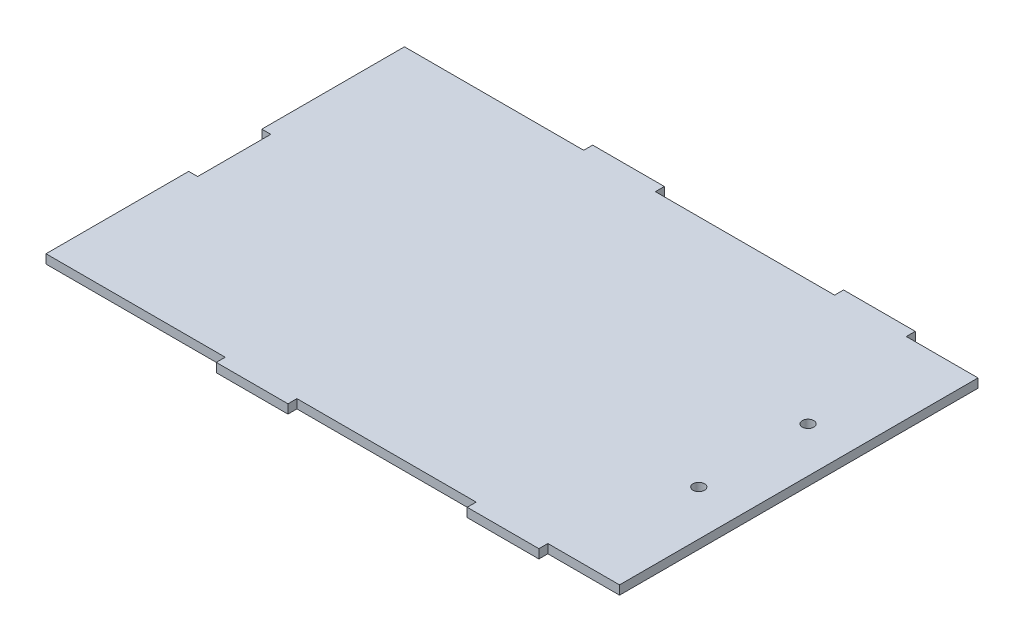
ISO-10303-21;
HEADER;
FILE_DESCRIPTION(('STEP AP214'),'2;1');
FILE_NAME('part.step','',(''),(''),'','','');
FILE_SCHEMA(('AUTOMOTIVE_DESIGN { 1 0 10303 214 1 1 1 1 }'));
ENDSEC;
DATA;
#1=APPLICATION_CONTEXT('core data for automotive mechanical design processes');
#2=APPLICATION_PROTOCOL_DEFINITION('international standard','automotive_design',2000,#1);
#3=PRODUCT_CONTEXT('',#1,'mechanical');
#4=PRODUCT('Part','Part','',(#3));
#5=PRODUCT_RELATED_PRODUCT_CATEGORY('part','',(#4));
#6=PRODUCT_DEFINITION_FORMATION('','',#4);
#7=PRODUCT_DEFINITION_CONTEXT('part definition',#1,'design');
#8=PRODUCT_DEFINITION('design','',#6,#7);
#9=PRODUCT_DEFINITION_SHAPE('','',#8);
#10=(LENGTH_UNIT() NAMED_UNIT(*) SI_UNIT(.MILLI.,.METRE.));
#11=(NAMED_UNIT(*) PLANE_ANGLE_UNIT() SI_UNIT($,.RADIAN.));
#12=(NAMED_UNIT(*) SI_UNIT($,.STERADIAN.) SOLID_ANGLE_UNIT());
#13=UNCERTAINTY_MEASURE_WITH_UNIT(LENGTH_MEASURE(1.E-05),#10,'distance_accuracy_value','');
#14=(GEOMETRIC_REPRESENTATION_CONTEXT(3) GLOBAL_UNCERTAINTY_ASSIGNED_CONTEXT((#13)) GLOBAL_UNIT_ASSIGNED_CONTEXT((#10,
#11,#12)) REPRESENTATION_CONTEXT('',''));
#15=CARTESIAN_POINT('',(0.,0.,0.));
#16=DIRECTION('',(0.,0.,1.));
#17=DIRECTION('',(1.,0.,0.));
#18=AXIS2_PLACEMENT_3D('',#15,#16,#17);
#19=CARTESIAN_POINT('',(-59.2381545070437,3.175,-74.9935826896622));
#20=DIRECTION('',(1.,0.,0.));
#21=DIRECTION('',(0.,0.,-1.));
#22=AXIS2_PLACEMENT_3D('',#19,#20,#21);
#23=PLANE('',#22);
#24=DIRECTION('',(0.,0.,1.));
#25=VECTOR('',#24,1.);
#26=CARTESIAN_POINT('',(-59.2381545070437,3.175,-74.9935826896622));
#27=LINE('',#26,#25);
#28=CARTESIAN_POINT('',(-59.2381545070437,3.175,1.46041731033783));
#29=VERTEX_POINT('',#28);
#30=CARTESIAN_POINT('',(-59.2381545070437,3.175,52.0064173103378));
#31=VERTEX_POINT('',#30);
#32=EDGE_CURVE('E354',#29,#31,#27,.T.);
#33=ORIENTED_EDGE('',*,*,#32,.F.);
#34=DIRECTION('',(0.,1.,0.));
#35=VECTOR('',#34,1.);
#36=CARTESIAN_POINT('',(-59.2381545070437,3.175,1.46041731033783));
#37=LINE('',#36,#35);
#38=CARTESIAN_POINT('',(-59.2381545070437,0.,1.46041731033784));
#39=VERTEX_POINT('',#38);
#40=EDGE_CURVE('E200',#39,#29,#37,.T.);
#41=ORIENTED_EDGE('',*,*,#40,.F.);
#42=DIRECTION('',(0.,0.,1.));
#43=VECTOR('',#42,1.);
#44=CARTESIAN_POINT('',(-59.2381545070437,0.,-74.9935826896622));
#45=LINE('',#44,#43);
#46=CARTESIAN_POINT('',(-59.2381545070437,0.,52.0064173103378));
#47=VERTEX_POINT('',#46);
#48=EDGE_CURVE('E348',#39,#47,#45,.T.);
#49=ORIENTED_EDGE('',*,*,#48,.T.);
#50=DIRECTION('',(0.,-1.,0.));
#51=VECTOR('',#50,1.);
#52=CARTESIAN_POINT('',(-59.2381545070437,3.175,52.0064173103378));
#53=LINE('',#52,#51);
#54=EDGE_CURVE('E11',#31,#47,#53,.T.);
#55=ORIENTED_EDGE('',*,*,#54,.F.);
#56=EDGE_LOOP('',(#33,#41,#49,#55));
#57=FACE_BOUND('',#56,.T.);
#58=ADVANCED_FACE('F33',(#57),#23,.F.);
#59=CARTESIAN_POINT('',(-59.2381545070437,3.175,-74.9935826896622));
#60=DIRECTION('',(0.,0.,1.));
#61=DIRECTION('',(1.,0.,0.));
#62=AXIS2_PLACEMENT_3D('',#59,#60,#61);
#63=PLANE('',#62);
#64=DIRECTION('',(0.,-1.,0.));
#65=VECTOR('',#64,1.);
#66=CARTESIAN_POINT('',(29.6618454929563,3.175,-74.9935826896622));
#67=LINE('',#66,#65);
#68=CARTESIAN_POINT('',(29.6618454929563,3.175,-74.9935826896622));
#69=VERTEX_POINT('',#68);
#70=CARTESIAN_POINT('',(29.6618454929563,0.,-74.9935826896622));
#71=VERTEX_POINT('',#70);
#72=EDGE_CURVE('E227',#69,#71,#67,.T.);
#73=ORIENTED_EDGE('',*,*,#72,.F.);
#74=DIRECTION('',(-1.,0.,0.));
#75=VECTOR('',#74,1.);
#76=CARTESIAN_POINT('',(-59.2381545070437,3.175,-74.9935826896622));
#77=LINE('',#76,#75);
#78=CARTESIAN_POINT('',(93.1618454929563,3.175,-74.9935826896622));
#79=VERTEX_POINT('',#78);
#80=EDGE_CURVE('E365',#79,#69,#77,.T.);
#81=ORIENTED_EDGE('',*,*,#80,.F.);
#82=DIRECTION('',(0.,1.,0.));
#83=VECTOR('',#82,1.);
#84=CARTESIAN_POINT('',(93.1618454929563,3.175,-74.9935826896622));
#85=LINE('',#84,#83);
#86=CARTESIAN_POINT('',(93.1618454929563,0.,-74.9935826896622));
#87=VERTEX_POINT('',#86);
#88=EDGE_CURVE('E262',#87,#79,#85,.T.);
#89=ORIENTED_EDGE('',*,*,#88,.F.);
#90=DIRECTION('',(-1.,0.,0.));
#91=VECTOR('',#90,1.);
#92=CARTESIAN_POINT('',(-59.2381545070437,0.,-74.9935826896622));
#93=LINE('',#92,#91);
#94=EDGE_CURVE('E378',#87,#71,#93,.T.);
#95=ORIENTED_EDGE('',*,*,#94,.T.);
#96=EDGE_LOOP('',(#73,#81,#89,#95));
#97=FACE_BOUND('',#96,.T.);
#98=ADVANCED_FACE('F418',(#97),#63,.F.);
#99=DIRECTION('',(0.,1.,0.));
#100=VECTOR('',#99,1.);
#101=CARTESIAN_POINT('',(4.26184549295627,3.17500000000003,-74.9935826896622));
#102=LINE('',#101,#100);
#103=CARTESIAN_POINT('',(4.26184549295627,0.,-74.9935826896622));
#104=VERTEX_POINT('',#103);
#105=CARTESIAN_POINT('',(4.26184549295627,3.175,-74.9935826896622));
#106=VERTEX_POINT('',#105);
#107=EDGE_CURVE('E236',#104,#106,#102,.T.);
#108=ORIENTED_EDGE('',*,*,#107,.F.);
#109=CARTESIAN_POINT('',(-59.2381545070437,0.,-74.9935826896622));
#110=VERTEX_POINT('',#109);
#111=EDGE_CURVE('E375',#104,#110,#93,.T.);
#112=ORIENTED_EDGE('',*,*,#111,.T.);
#113=DIRECTION('',(0.,-1.,0.));
#114=VECTOR('',#113,1.);
#115=CARTESIAN_POINT('',(-59.2381545070437,3.175,-74.9935826896622));
#116=LINE('',#115,#114);
#117=CARTESIAN_POINT('',(-59.2381545070437,3.175,-74.9935826896622));
#118=VERTEX_POINT('',#117);
#119=EDGE_CURVE('E364',#118,#110,#116,.T.);
#120=ORIENTED_EDGE('',*,*,#119,.F.);
#121=EDGE_CURVE('E56',#106,#118,#77,.T.);
#122=ORIENTED_EDGE('',*,*,#121,.F.);
#123=EDGE_LOOP('',(#108,#112,#120,#122));
#124=FACE_BOUND('',#123,.T.);
#125=ADVANCED_FACE('F420',(#124),#63,.F.);
#126=DIRECTION('',(0.,-1.,0.));
#127=VECTOR('',#126,1.);
#128=CARTESIAN_POINT('',(118.561845492956,3.175,-74.9935826896622));
#129=LINE('',#128,#127);
#130=CARTESIAN_POINT('',(118.561845492956,3.175,-74.9935826896622));
#131=VERTEX_POINT('',#130);
#132=CARTESIAN_POINT('',(118.561845492956,0.,-74.9935826896622));
#133=VERTEX_POINT('',#132);
#134=EDGE_CURVE('E257',#131,#133,#129,.T.);
#135=ORIENTED_EDGE('',*,*,#134,.F.);
#136=CARTESIAN_POINT('',(143.961845492956,3.175,-74.9935826896622));
#137=VERTEX_POINT('',#136);
#138=EDGE_CURVE('E361',#137,#131,#77,.T.);
#139=ORIENTED_EDGE('',*,*,#138,.F.);
#140=DIRECTION('',(0.,-1.,0.));
#141=VECTOR('',#140,1.);
#142=CARTESIAN_POINT('',(143.961845492956,3.175,-74.9935826896622));
#143=LINE('',#142,#141);
#144=CARTESIAN_POINT('',(143.961845492956,0.,-74.9935826896622));
#145=VERTEX_POINT('',#144);
#146=EDGE_CURVE('E381',#137,#145,#143,.T.);
#147=ORIENTED_EDGE('',*,*,#146,.T.);
#148=EDGE_CURVE('E376',#145,#133,#93,.T.);
#149=ORIENTED_EDGE('',*,*,#148,.T.);
#150=EDGE_LOOP('',(#135,#139,#147,#149));
#151=FACE_BOUND('',#150,.T.);
#152=ADVANCED_FACE('F400',(#151),#63,.F.);
#153=CARTESIAN_POINT('',(-59.2381545070437,3.175,52.0064173103378));
#154=DIRECTION('',(0.,0.,-1.));
#155=DIRECTION('',(-1.,0.,0.));
#156=AXIS2_PLACEMENT_3D('',#153,#154,#155);
#157=PLANE('',#156);
#158=DIRECTION('',(0.,-1.,0.));
#159=VECTOR('',#158,1.);
#160=CARTESIAN_POINT('',(93.1618454929563,3.175,52.0064173103378));
#161=LINE('',#160,#159);
#162=CARTESIAN_POINT('',(93.1618454929563,3.175,52.0064173103378));
#163=VERTEX_POINT('',#162);
#164=CARTESIAN_POINT('',(93.1618454929563,0.,52.0064173103378));
#165=VERTEX_POINT('',#164);
#166=EDGE_CURVE('E284',#163,#165,#161,.T.);
#167=ORIENTED_EDGE('',*,*,#166,.F.);
#168=DIRECTION('',(1.,0.,0.));
#169=VECTOR('',#168,1.);
#170=CARTESIAN_POINT('',(-59.2381545070437,3.175,52.0064173103378));
#171=LINE('',#170,#169);
#172=CARTESIAN_POINT('',(29.6618454929563,3.175,52.0064173103378));
#173=VERTEX_POINT('',#172);
#174=EDGE_CURVE('E359',#173,#163,#171,.T.);
#175=ORIENTED_EDGE('',*,*,#174,.F.);
#176=DIRECTION('',(0.,1.,0.));
#177=VECTOR('',#176,1.);
#178=CARTESIAN_POINT('',(29.6618454929563,3.175,52.0064173103378));
#179=LINE('',#178,#177);
#180=CARTESIAN_POINT('',(29.6618454929563,0.,52.0064173103378));
#181=VERTEX_POINT('',#180);
#182=EDGE_CURVE('E311',#181,#173,#179,.T.);
#183=ORIENTED_EDGE('',*,*,#182,.F.);
#184=DIRECTION('',(1.,0.,0.));
#185=VECTOR('',#184,1.);
#186=CARTESIAN_POINT('',(-59.2381545070437,0.,52.0064173103378));
#187=LINE('',#186,#185);
#188=EDGE_CURVE('E373',#181,#165,#187,.T.);
#189=ORIENTED_EDGE('',*,*,#188,.T.);
#190=EDGE_LOOP('',(#167,#175,#183,#189));
#191=FACE_BOUND('',#190,.T.);
#192=ADVANCED_FACE('F465',(#191),#157,.F.);
#193=DIRECTION('',(0.,1.,0.));
#194=VECTOR('',#193,1.);
#195=CARTESIAN_POINT('',(118.561845492956,3.175,52.0064173103378));
#196=LINE('',#195,#194);
#197=CARTESIAN_POINT('',(118.561845492956,0.,52.0064173103378));
#198=VERTEX_POINT('',#197);
#199=CARTESIAN_POINT('',(118.561845492956,3.175,52.0064173103378));
#200=VERTEX_POINT('',#199);
#201=EDGE_CURVE('E289',#198,#200,#196,.T.);
#202=ORIENTED_EDGE('',*,*,#201,.F.);
#203=CARTESIAN_POINT('',(143.961845492956,0.,52.0064173103378));
#204=VERTEX_POINT('',#203);
#205=EDGE_CURVE('E369',#198,#204,#187,.T.);
#206=ORIENTED_EDGE('',*,*,#205,.T.);
#207=DIRECTION('',(0.,-1.,0.));
#208=VECTOR('',#207,1.);
#209=CARTESIAN_POINT('',(143.961845492956,3.175,52.0064173103378));
#210=LINE('',#209,#208);
#211=CARTESIAN_POINT('',(143.961845492956,3.175,52.0064173103378));
#212=VERTEX_POINT('',#211);
#213=EDGE_CURVE('E41',#212,#204,#210,.T.);
#214=ORIENTED_EDGE('',*,*,#213,.F.);
#215=EDGE_CURVE('E353',#200,#212,#171,.T.);
#216=ORIENTED_EDGE('',*,*,#215,.F.);
#217=EDGE_LOOP('',(#202,#206,#214,#216));
#218=FACE_BOUND('',#217,.T.);
#219=ADVANCED_FACE('F467',(#218),#157,.F.);
#220=DIRECTION('',(0.,-1.,0.));
#221=VECTOR('',#220,1.);
#222=CARTESIAN_POINT('',(4.26184549295627,3.175,52.0064173103378));
#223=LINE('',#222,#221);
#224=CARTESIAN_POINT('',(4.26184549295627,3.175,52.0064173103378));
#225=VERTEX_POINT('',#224);
#226=CARTESIAN_POINT('',(4.26184549295627,0.,52.0064173103378));
#227=VERTEX_POINT('',#226);
#228=EDGE_CURVE('E316',#225,#227,#223,.T.);
#229=ORIENTED_EDGE('',*,*,#228,.F.);
#230=EDGE_CURVE('E355',#31,#225,#171,.T.);
#231=ORIENTED_EDGE('',*,*,#230,.F.);
#232=ORIENTED_EDGE('',*,*,#54,.T.);
#233=EDGE_CURVE('E370',#47,#227,#187,.T.);
#234=ORIENTED_EDGE('',*,*,#233,.T.);
#235=EDGE_LOOP('',(#229,#231,#232,#234));
#236=FACE_BOUND('',#235,.T.);
#237=ADVANCED_FACE('F461',(#236),#157,.F.);
#238=CARTESIAN_POINT('',(0.,3.175,0.));
#239=DIRECTION('',(0.,1.,0.));
#240=DIRECTION('',(0.,0.,1.));
#241=AXIS2_PLACEMENT_3D('',#238,#239,#240);
#242=PLANE('',#241);
#243=DIRECTION('',(-1.,0.,0.));
#244=VECTOR('',#243,1.);
#245=CARTESIAN_POINT('',(-56.0631545070437,3.175,1.46041731033783));
#246=LINE('',#245,#244);
#247=CARTESIAN_POINT('',(-56.0631545070437,3.175,1.46041731033783));
#248=VERTEX_POINT('',#247);
#249=EDGE_CURVE('E194',#248,#29,#246,.T.);
#250=ORIENTED_EDGE('',*,*,#249,.T.);
#251=ORIENTED_EDGE('',*,*,#32,.T.);
#252=ORIENTED_EDGE('',*,*,#230,.T.);
#253=DIRECTION('',(0.,0.,-1.));
#254=VECTOR('',#253,1.);
#255=CARTESIAN_POINT('',(4.26184549295627,3.175,55.1814173103378));
#256=LINE('',#255,#254);
#257=CARTESIAN_POINT('',(4.26184549295627,3.175,55.1814173103378));
#258=VERTEX_POINT('',#257);
#259=EDGE_CURVE('E332',#258,#225,#256,.T.);
#260=ORIENTED_EDGE('',*,*,#259,.F.);
#261=DIRECTION('',(-1.,0.,0.));
#262=VECTOR('',#261,1.);
#263=CARTESIAN_POINT('',(29.6618454929563,3.175,55.1814173103378));
#264=LINE('',#263,#262);
#265=CARTESIAN_POINT('',(29.6618454929563,3.175,55.1814173103378));
#266=VERTEX_POINT('',#265);
#267=EDGE_CURVE('E315',#266,#258,#264,.T.);
#268=ORIENTED_EDGE('',*,*,#267,.F.);
#269=DIRECTION('',(0.,0.,-1.));
#270=VECTOR('',#269,1.);
#271=CARTESIAN_POINT('',(29.6618454929563,3.175,55.1814173103378));
#272=LINE('',#271,#270);
#273=EDGE_CURVE('E335',#266,#173,#272,.T.);
#274=ORIENTED_EDGE('',*,*,#273,.T.);
#275=ORIENTED_EDGE('',*,*,#174,.T.);
#276=DIRECTION('',(0.,0.,-1.));
#277=VECTOR('',#276,1.);
#278=CARTESIAN_POINT('',(93.1618454929563,3.175,55.1814173103378));
#279=LINE('',#278,#277);
#280=CARTESIAN_POINT('',(93.1618454929563,3.175,55.1814173103378));
#281=VERTEX_POINT('',#280);
#282=EDGE_CURVE('E295',#281,#163,#279,.T.);
#283=ORIENTED_EDGE('',*,*,#282,.F.);
#284=DIRECTION('',(-1.,0.,0.));
#285=VECTOR('',#284,1.);
#286=CARTESIAN_POINT('',(93.1618454929563,3.175,55.1814173103378));
#287=LINE('',#286,#285);
#288=CARTESIAN_POINT('',(118.561845492956,3.175,55.1814173103378));
#289=VERTEX_POINT('',#288);
#290=EDGE_CURVE('E293',#289,#281,#287,.T.);
#291=ORIENTED_EDGE('',*,*,#290,.F.);
#292=DIRECTION('',(0.,0.,-1.));
#293=VECTOR('',#292,1.);
#294=CARTESIAN_POINT('',(118.561845492956,3.175,55.1814173103378));
#295=LINE('',#294,#293);
#296=EDGE_CURVE('E302',#289,#200,#295,.T.);
#297=ORIENTED_EDGE('',*,*,#296,.T.);
#298=ORIENTED_EDGE('',*,*,#215,.T.);
#299=DIRECTION('',(0.,0.,-1.));
#300=VECTOR('',#299,1.);
#301=CARTESIAN_POINT('',(143.961845492956,3.175,-74.9935826896622));
#302=LINE('',#301,#300);
#303=EDGE_CURVE('E358',#212,#137,#302,.T.);
#304=ORIENTED_EDGE('',*,*,#303,.T.);
#305=ORIENTED_EDGE('',*,*,#138,.T.);
#306=DIRECTION('',(0.,0.,1.));
#307=VECTOR('',#306,1.);
#308=CARTESIAN_POINT('',(118.561845492956,3.175,-78.1685826896622));
#309=LINE('',#308,#307);
#310=CARTESIAN_POINT('',(118.561845492956,3.175,-78.1685826896622));
#311=VERTEX_POINT('',#310);
#312=EDGE_CURVE('E268',#311,#131,#309,.T.);
#313=ORIENTED_EDGE('',*,*,#312,.F.);
#314=DIRECTION('',(1.,0.,0.));
#315=VECTOR('',#314,1.);
#316=CARTESIAN_POINT('',(118.561845492956,3.175,-78.1685826896622));
#317=LINE('',#316,#315);
#318=CARTESIAN_POINT('',(93.1618454929563,3.175,-78.1685826896622));
#319=VERTEX_POINT('',#318);
#320=EDGE_CURVE('E266',#319,#311,#317,.T.);
#321=ORIENTED_EDGE('',*,*,#320,.F.);
#322=DIRECTION('',(0.,0.,1.));
#323=VECTOR('',#322,1.);
#324=CARTESIAN_POINT('',(93.1618454929563,3.175,-78.1685826896622));
#325=LINE('',#324,#323);
#326=EDGE_CURVE('E275',#319,#79,#325,.T.);
#327=ORIENTED_EDGE('',*,*,#326,.T.);
#328=ORIENTED_EDGE('',*,*,#80,.T.);
#329=DIRECTION('',(0.,0.,1.));
#330=VECTOR('',#329,1.);
#331=CARTESIAN_POINT('',(29.6618454929563,3.175,-78.1685826896622));
#332=LINE('',#331,#330);
#333=CARTESIAN_POINT('',(29.6618454929563,3.175,-78.1685826896622));
#334=VERTEX_POINT('',#333);
#335=EDGE_CURVE('E242',#334,#69,#332,.T.);
#336=ORIENTED_EDGE('',*,*,#335,.F.);
#337=DIRECTION('',(1.,0.,0.));
#338=VECTOR('',#337,1.);
#339=CARTESIAN_POINT('',(29.6618454929563,3.175,-78.1685826896622));
#340=LINE('',#339,#338);
#341=CARTESIAN_POINT('',(4.26184549295627,3.17500000000003,-78.1685826896622));
#342=VERTEX_POINT('',#341);
#343=EDGE_CURVE('E240',#342,#334,#340,.T.);
#344=ORIENTED_EDGE('',*,*,#343,.F.);
#345=DIRECTION('',(0.,0.,1.));
#346=VECTOR('',#345,1.);
#347=CARTESIAN_POINT('',(4.26184549295627,3.17500000000003,-78.1685826896622));
#348=LINE('',#347,#346);
#349=EDGE_CURVE('E248',#342,#106,#348,.T.);
#350=ORIENTED_EDGE('',*,*,#349,.T.);
#351=ORIENTED_EDGE('',*,*,#121,.T.);
#352=CARTESIAN_POINT('',(-59.2381545070437,3.175,-24.4475826896622));
#353=VERTEX_POINT('',#352);
#354=EDGE_CURVE('E351',#118,#353,#27,.T.);
#355=ORIENTED_EDGE('',*,*,#354,.T.);
#356=DIRECTION('',(-1.,0.,0.));
#357=VECTOR('',#356,1.);
#358=CARTESIAN_POINT('',(-56.0631545070437,3.17499999999999,-24.4475826896622));
#359=LINE('',#358,#357);
#360=CARTESIAN_POINT('',(-56.0631545070437,3.17499999999999,-24.4475826896622));
#361=VERTEX_POINT('',#360);
#362=EDGE_CURVE('E48',#361,#353,#359,.T.);
#363=ORIENTED_EDGE('',*,*,#362,.F.);
#364=DIRECTION('',(0.,0.,-1.));
#365=VECTOR('',#364,1.);
#366=CARTESIAN_POINT('',(-56.0631545070437,3.175,1.46041731033783));
#367=LINE('',#366,#365);
#368=EDGE_CURVE('E210',#248,#361,#367,.T.);
#369=ORIENTED_EDGE('',*,*,#368,.F.);
#370=EDGE_LOOP('',(#250,#251,#252,#260,#268,#274,#275,#283,#291,#297,#298,#304,#305,#313,#321,
#327,#328,#336,#344,#350,#351,#355,#363,#369));
#371=FACE_BOUND('',#370,.T.);
#372=CARTESIAN_POINT('',(127.959845492956,3.175,7.93741731033784));
#373=DIRECTION('',(0.,1.,0.));
#374=DIRECTION('',(0.,0.,1.));
#375=AXIS2_PLACEMENT_3D('',#372,#373,#374);
#376=CIRCLE('',#375,2.03200000000004);
#377=CARTESIAN_POINT('',(127.959845492956,3.175,9.96941731033788));
#378=VERTEX_POINT('',#377);
#379=EDGE_CURVE('E345',#378,#378,#376,.T.);
#380=ORIENTED_EDGE('',*,*,#379,.F.);
#381=EDGE_LOOP('',(#380));
#382=FACE_BOUND('',#381,.T.);
#383=CARTESIAN_POINT('',(127.959845492956,3.175,-30.7975826896622));
#384=DIRECTION('',(0.,1.,0.));
#385=DIRECTION('',(0.,0.,1.));
#386=AXIS2_PLACEMENT_3D('',#383,#384,#385);
#387=CIRCLE('',#386,2.03200000000004);
#388=CARTESIAN_POINT('',(127.959845492956,3.175,-28.7655826896621));
#389=VERTEX_POINT('',#388);
#390=EDGE_CURVE('E339',#389,#389,#387,.T.);
#391=ORIENTED_EDGE('',*,*,#390,.F.);
#392=EDGE_LOOP('',(#391));
#393=FACE_BOUND('',#392,.T.);
#394=ADVANCED_FACE('F215',(#371,#382,#393),#242,.T.);
#395=CARTESIAN_POINT('',(0.,0.,0.));
#396=DIRECTION('',(0.,1.,0.));
#397=DIRECTION('',(0.,0.,1.));
#398=AXIS2_PLACEMENT_3D('',#395,#396,#397);
#399=PLANE('',#398);
#400=ORIENTED_EDGE('',*,*,#48,.F.);
#401=DIRECTION('',(-1.,0.,0.));
#402=VECTOR('',#401,1.);
#403=CARTESIAN_POINT('',(-56.0631545070437,0.,1.46041731033784));
#404=LINE('',#403,#402);
#405=CARTESIAN_POINT('',(-56.0631545070437,0.,1.46041731033784));
#406=VERTEX_POINT('',#405);
#407=EDGE_CURVE('E225',#406,#39,#404,.T.);
#408=ORIENTED_EDGE('',*,*,#407,.F.);
#409=DIRECTION('',(0.,0.,1.));
#410=VECTOR('',#409,1.);
#411=CARTESIAN_POINT('',(-56.0631545070437,0.,1.46041731033784));
#412=LINE('',#411,#410);
#413=CARTESIAN_POINT('',(-56.0631545070437,0.,-24.4475826896622));
#414=VERTEX_POINT('',#413);
#415=EDGE_CURVE('E204',#414,#406,#412,.T.);
#416=ORIENTED_EDGE('',*,*,#415,.F.);
#417=DIRECTION('',(-1.,0.,0.));
#418=VECTOR('',#417,1.);
#419=CARTESIAN_POINT('',(-56.0631545070437,0.,-24.4475826896622));
#420=LINE('',#419,#418);
#421=CARTESIAN_POINT('',(-59.2381545070437,0.,-24.4475826896622));
#422=VERTEX_POINT('',#421);
#423=EDGE_CURVE('E228',#414,#422,#420,.T.);
#424=ORIENTED_EDGE('',*,*,#423,.T.);
#425=EDGE_CURVE('E366',#110,#422,#45,.T.);
#426=ORIENTED_EDGE('',*,*,#425,.F.);
#427=ORIENTED_EDGE('',*,*,#111,.F.);
#428=DIRECTION('',(0.,0.,1.));
#429=VECTOR('',#428,1.);
#430=CARTESIAN_POINT('',(4.26184549295627,0.,-78.1685826896622));
#431=LINE('',#430,#429);
#432=CARTESIAN_POINT('',(4.26184549295627,0.,-78.1685826896622));
#433=VERTEX_POINT('',#432);
#434=EDGE_CURVE('E251',#433,#104,#431,.T.);
#435=ORIENTED_EDGE('',*,*,#434,.F.);
#436=DIRECTION('',(-1.,0.,0.));
#437=VECTOR('',#436,1.);
#438=CARTESIAN_POINT('',(29.6618454929563,0.,-78.1685826896622));
#439=LINE('',#438,#437);
#440=CARTESIAN_POINT('',(29.6618454929563,0.,-78.1685826896622));
#441=VERTEX_POINT('',#440);
#442=EDGE_CURVE('E235',#441,#433,#439,.T.);
#443=ORIENTED_EDGE('',*,*,#442,.F.);
#444=DIRECTION('',(0.,0.,1.));
#445=VECTOR('',#444,1.);
#446=CARTESIAN_POINT('',(29.6618454929563,0.,-78.1685826896622));
#447=LINE('',#446,#445);
#448=EDGE_CURVE('E254',#441,#71,#447,.T.);
#449=ORIENTED_EDGE('',*,*,#448,.T.);
#450=ORIENTED_EDGE('',*,*,#94,.F.);
#451=DIRECTION('',(0.,0.,1.));
#452=VECTOR('',#451,1.);
#453=CARTESIAN_POINT('',(93.1618454929563,0.,-78.1685826896622));
#454=LINE('',#453,#452);
#455=CARTESIAN_POINT('',(93.1618454929563,0.,-78.1685826896622));
#456=VERTEX_POINT('',#455);
#457=EDGE_CURVE('E278',#456,#87,#454,.T.);
#458=ORIENTED_EDGE('',*,*,#457,.F.);
#459=DIRECTION('',(-1.,0.,0.));
#460=VECTOR('',#459,1.);
#461=CARTESIAN_POINT('',(118.561845492956,0.,-78.1685826896622));
#462=LINE('',#461,#460);
#463=CARTESIAN_POINT('',(118.561845492956,0.,-78.1685826896622));
#464=VERTEX_POINT('',#463);
#465=EDGE_CURVE('E261',#464,#456,#462,.T.);
#466=ORIENTED_EDGE('',*,*,#465,.F.);
#467=DIRECTION('',(0.,0.,1.));
#468=VECTOR('',#467,1.);
#469=CARTESIAN_POINT('',(118.561845492956,0.,-78.1685826896622));
#470=LINE('',#469,#468);
#471=EDGE_CURVE('E281',#464,#133,#470,.T.);
#472=ORIENTED_EDGE('',*,*,#471,.T.);
#473=ORIENTED_EDGE('',*,*,#148,.F.);
#474=DIRECTION('',(0.,0.,-1.));
#475=VECTOR('',#474,1.);
#476=CARTESIAN_POINT('',(143.961845492956,0.,-74.9935826896622));
#477=LINE('',#476,#475);
#478=EDGE_CURVE('E372',#204,#145,#477,.T.);
#479=ORIENTED_EDGE('',*,*,#478,.F.);
#480=ORIENTED_EDGE('',*,*,#205,.F.);
#481=DIRECTION('',(0.,0.,-1.));
#482=VECTOR('',#481,1.);
#483=CARTESIAN_POINT('',(118.561845492956,0.,55.1814173103378));
#484=LINE('',#483,#482);
#485=CARTESIAN_POINT('',(118.561845492956,0.,55.1814173103378));
#486=VERTEX_POINT('',#485);
#487=EDGE_CURVE('E305',#486,#198,#484,.T.);
#488=ORIENTED_EDGE('',*,*,#487,.F.);
#489=DIRECTION('',(1.,0.,0.));
#490=VECTOR('',#489,1.);
#491=CARTESIAN_POINT('',(93.1618454929563,0.,55.1814173103378));
#492=LINE('',#491,#490);
#493=CARTESIAN_POINT('',(93.1618454929563,0.,55.1814173103378));
#494=VERTEX_POINT('',#493);
#495=EDGE_CURVE('E288',#494,#486,#492,.T.);
#496=ORIENTED_EDGE('',*,*,#495,.F.);
#497=DIRECTION('',(0.,0.,-1.));
#498=VECTOR('',#497,1.);
#499=CARTESIAN_POINT('',(93.1618454929563,0.,55.1814173103378));
#500=LINE('',#499,#498);
#501=EDGE_CURVE('E308',#494,#165,#500,.T.);
#502=ORIENTED_EDGE('',*,*,#501,.T.);
#503=ORIENTED_EDGE('',*,*,#188,.F.);
#504=DIRECTION('',(0.,0.,-1.));
#505=VECTOR('',#504,1.);
#506=CARTESIAN_POINT('',(29.6618454929563,0.,55.1814173103378));
#507=LINE('',#506,#505);
#508=CARTESIAN_POINT('',(29.6618454929563,0.,55.1814173103378));
#509=VERTEX_POINT('',#508);
#510=EDGE_CURVE('E322',#509,#181,#507,.T.);
#511=ORIENTED_EDGE('',*,*,#510,.F.);
#512=DIRECTION('',(1.,0.,0.));
#513=VECTOR('',#512,1.);
#514=CARTESIAN_POINT('',(29.6618454929563,0.,55.1814173103378));
#515=LINE('',#514,#513);
#516=CARTESIAN_POINT('',(4.26184549295627,0.,55.1814173103378));
#517=VERTEX_POINT('',#516);
#518=EDGE_CURVE('E320',#517,#509,#515,.T.);
#519=ORIENTED_EDGE('',*,*,#518,.F.);
#520=DIRECTION('',(0.,0.,-1.));
#521=VECTOR('',#520,1.);
#522=CARTESIAN_POINT('',(4.26184549295627,0.,55.1814173103378));
#523=LINE('',#522,#521);
#524=EDGE_CURVE('E329',#517,#227,#523,.T.);
#525=ORIENTED_EDGE('',*,*,#524,.T.);
#526=ORIENTED_EDGE('',*,*,#233,.F.);
#527=EDGE_LOOP('',(#400,#408,#416,#424,#426,#427,#435,#443,#449,#450,#458,#466,#472,#473,#479,
#480,#488,#496,#502,#503,#511,#519,#525,#526));
#528=FACE_BOUND('',#527,.T.);
#529=CARTESIAN_POINT('',(127.959845492956,0.,7.93741731033784));
#530=DIRECTION('',(0.,1.,0.));
#531=DIRECTION('',(0.,0.,1.));
#532=AXIS2_PLACEMENT_3D('',#529,#530,#531);
#533=CIRCLE('',#532,2.03200000000004);
#534=CARTESIAN_POINT('',(127.959845492956,0.,9.96941731033788));
#535=VERTEX_POINT('',#534);
#536=EDGE_CURVE('E342',#535,#535,#533,.T.);
#537=ORIENTED_EDGE('',*,*,#536,.T.);
#538=EDGE_LOOP('',(#537));
#539=FACE_BOUND('',#538,.T.);
#540=CARTESIAN_POINT('',(127.959845492956,0.,-30.7975826896622));
#541=DIRECTION('',(0.,1.,0.));
#542=DIRECTION('',(0.,0.,1.));
#543=AXIS2_PLACEMENT_3D('',#540,#541,#542);
#544=CIRCLE('',#543,2.03200000000004);
#545=CARTESIAN_POINT('',(127.959845492956,0.,-28.7655826896621));
#546=VERTEX_POINT('',#545);
#547=EDGE_CURVE('E338',#546,#546,#544,.T.);
#548=ORIENTED_EDGE('',*,*,#547,.T.);
#549=EDGE_LOOP('',(#548));
#550=FACE_BOUND('',#549,.T.);
#551=ADVANCED_FACE('F394',(#528,#539,#550),#399,.F.);
#552=ORIENTED_EDGE('',*,*,#425,.T.);
#553=DIRECTION('',(0.,-1.,0.));
#554=VECTOR('',#553,1.);
#555=CARTESIAN_POINT('',(-59.2381545070437,3.17499999999999,-24.4475826896622));
#556=LINE('',#555,#554);
#557=EDGE_CURVE('E213',#353,#422,#556,.T.);
#558=ORIENTED_EDGE('',*,*,#557,.F.);
#559=ORIENTED_EDGE('',*,*,#354,.F.);
#560=ORIENTED_EDGE('',*,*,#119,.T.);
#561=EDGE_LOOP('',(#552,#558,#559,#560));
#562=FACE_BOUND('',#561,.T.);
#563=ADVANCED_FACE('F35',(#562),#23,.F.);
#564=CARTESIAN_POINT('',(143.961845492956,3.175,-74.9935826896622));
#565=DIRECTION('',(-1.,0.,0.));
#566=DIRECTION('',(0.,0.,1.));
#567=AXIS2_PLACEMENT_3D('',#564,#565,#566);
#568=PLANE('',#567);
#569=ORIENTED_EDGE('',*,*,#478,.T.);
#570=ORIENTED_EDGE('',*,*,#146,.F.);
#571=ORIENTED_EDGE('',*,*,#303,.F.);
#572=ORIENTED_EDGE('',*,*,#213,.T.);
#573=EDGE_LOOP('',(#569,#570,#571,#572));
#574=FACE_BOUND('',#573,.T.);
#575=ADVANCED_FACE('F388',(#574),#568,.F.);
#576=CARTESIAN_POINT('',(127.959845492956,3.175,7.93741731033784));
#577=DIRECTION('',(0.,-1.,0.));
#578=DIRECTION('',(0.,0.,-1.));
#579=AXIS2_PLACEMENT_3D('',#576,#577,#578);
#580=CYLINDRICAL_SURFACE('',#579,2.03200000000004);
#581=ORIENTED_EDGE('',*,*,#379,.T.);
#582=EDGE_LOOP('',(#581));
#583=FACE_BOUND('',#582,.T.);
#584=ORIENTED_EDGE('',*,*,#536,.F.);
#585=EDGE_LOOP('',(#584));
#586=FACE_BOUND('',#585,.T.);
#587=ADVANCED_FACE('F455',(#583,#586),#580,.F.);
#588=CARTESIAN_POINT('',(127.959845492956,3.175,-30.7975826896622));
#589=DIRECTION('',(0.,-1.,0.));
#590=DIRECTION('',(0.,0.,-1.));
#591=AXIS2_PLACEMENT_3D('',#588,#589,#590);
#592=CYLINDRICAL_SURFACE('',#591,2.03200000000004);
#593=ORIENTED_EDGE('',*,*,#390,.T.);
#594=EDGE_LOOP('',(#593));
#595=FACE_BOUND('',#594,.T.);
#596=ORIENTED_EDGE('',*,*,#547,.F.);
#597=EDGE_LOOP('',(#596));
#598=FACE_BOUND('',#597,.T.);
#599=ADVANCED_FACE('F520',(#595,#598),#592,.F.);
#600=CARTESIAN_POINT('',(29.6618454929563,3.175,55.1814173103378));
#601=DIRECTION('',(-1.,0.,0.));
#602=DIRECTION('',(0.,-1.,0.));
#603=AXIS2_PLACEMENT_3D('',#600,#601,#602);
#604=PLANE('',#603);
#605=ORIENTED_EDGE('',*,*,#182,.T.);
#606=ORIENTED_EDGE('',*,*,#273,.F.);
#607=DIRECTION('',(0.,1.,0.));
#608=VECTOR('',#607,1.);
#609=CARTESIAN_POINT('',(29.6618454929563,3.175,55.1814173103378));
#610=LINE('',#609,#608);
#611=EDGE_CURVE('E312',#509,#266,#610,.T.);
#612=ORIENTED_EDGE('',*,*,#611,.F.);
#613=ORIENTED_EDGE('',*,*,#510,.T.);
#614=EDGE_LOOP('',(#605,#606,#612,#613));
#615=FACE_BOUND('',#614,.T.);
#616=ADVANCED_FACE('F493',(#615),#604,.F.);
#617=CARTESIAN_POINT('',(4.26184549295627,3.175,55.1814173103378));
#618=DIRECTION('',(1.,0.,0.));
#619=DIRECTION('',(0.,0.,-1.));
#620=AXIS2_PLACEMENT_3D('',#617,#618,#619);
#621=PLANE('',#620);
#622=ORIENTED_EDGE('',*,*,#228,.T.);
#623=ORIENTED_EDGE('',*,*,#524,.F.);
#624=DIRECTION('',(0.,-1.,0.));
#625=VECTOR('',#624,1.);
#626=CARTESIAN_POINT('',(4.26184549295627,3.175,55.1814173103378));
#627=LINE('',#626,#625);
#628=EDGE_CURVE('E318',#258,#517,#627,.T.);
#629=ORIENTED_EDGE('',*,*,#628,.F.);
#630=ORIENTED_EDGE('',*,*,#259,.T.);
#631=EDGE_LOOP('',(#622,#623,#629,#630));
#632=FACE_BOUND('',#631,.T.);
#633=ADVANCED_FACE('F483',(#632),#621,.F.);
#634=CARTESIAN_POINT('',(0.,0.,55.1814173103378));
#635=DIRECTION('',(0.,0.,-1.));
#636=DIRECTION('',(-1.,0.,0.));
#637=AXIS2_PLACEMENT_3D('',#634,#635,#636);
#638=PLANE('',#637);
#639=ORIENTED_EDGE('',*,*,#611,.T.);
#640=ORIENTED_EDGE('',*,*,#267,.T.);
#641=ORIENTED_EDGE('',*,*,#628,.T.);
#642=ORIENTED_EDGE('',*,*,#518,.T.);
#643=EDGE_LOOP('',(#639,#640,#641,#642));
#644=FACE_BOUND('',#643,.T.);
#645=ADVANCED_FACE('F486',(#644),#638,.F.);
#646=CARTESIAN_POINT('',(93.1618454929563,3.175,55.1814173103378));
#647=DIRECTION('',(1.,0.,0.));
#648=DIRECTION('',(0.,0.,-1.));
#649=AXIS2_PLACEMENT_3D('',#646,#647,#648);
#650=PLANE('',#649);
#651=ORIENTED_EDGE('',*,*,#166,.T.);
#652=ORIENTED_EDGE('',*,*,#501,.F.);
#653=DIRECTION('',(0.,-1.,0.));
#654=VECTOR('',#653,1.);
#655=CARTESIAN_POINT('',(93.1618454929563,3.175,55.1814173103378));
#656=LINE('',#655,#654);
#657=EDGE_CURVE('E285',#281,#494,#656,.T.);
#658=ORIENTED_EDGE('',*,*,#657,.F.);
#659=ORIENTED_EDGE('',*,*,#282,.T.);
#660=EDGE_LOOP('',(#651,#652,#658,#659));
#661=FACE_BOUND('',#660,.T.);
#662=ADVANCED_FACE('F505',(#661),#650,.F.);
#663=CARTESIAN_POINT('',(118.561845492956,3.175,55.1814173103378));
#664=DIRECTION('',(-1.,0.,0.));
#665=DIRECTION('',(0.,0.,1.));
#666=AXIS2_PLACEMENT_3D('',#663,#664,#665);
#667=PLANE('',#666);
#668=ORIENTED_EDGE('',*,*,#201,.T.);
#669=ORIENTED_EDGE('',*,*,#296,.F.);
#670=DIRECTION('',(0.,1.,0.));
#671=VECTOR('',#670,1.);
#672=CARTESIAN_POINT('',(118.561845492956,3.175,55.1814173103378));
#673=LINE('',#672,#671);
#674=EDGE_CURVE('E291',#486,#289,#673,.T.);
#675=ORIENTED_EDGE('',*,*,#674,.F.);
#676=ORIENTED_EDGE('',*,*,#487,.T.);
#677=EDGE_LOOP('',(#668,#669,#675,#676));
#678=FACE_BOUND('',#677,.T.);
#679=ADVANCED_FACE('F499',(#678),#667,.F.);
#680=CARTESIAN_POINT('',(0.,0.,55.1814173103378));
#681=DIRECTION('',(0.,0.,1.));
#682=DIRECTION('',(1.,0.,0.));
#683=AXIS2_PLACEMENT_3D('',#680,#681,#682);
#684=PLANE('',#683);
#685=ORIENTED_EDGE('',*,*,#657,.T.);
#686=ORIENTED_EDGE('',*,*,#495,.T.);
#687=ORIENTED_EDGE('',*,*,#674,.T.);
#688=ORIENTED_EDGE('',*,*,#290,.T.);
#689=EDGE_LOOP('',(#685,#686,#687,#688));
#690=FACE_BOUND('',#689,.T.);
#691=ADVANCED_FACE('F502',(#690),#684,.T.);
#692=CARTESIAN_POINT('',(118.561845492956,3.175,-78.1685826896622));
#693=DIRECTION('',(-1.,0.,0.));
#694=DIRECTION('',(0.,0.,1.));
#695=AXIS2_PLACEMENT_3D('',#692,#693,#694);
#696=PLANE('',#695);
#697=ORIENTED_EDGE('',*,*,#134,.T.);
#698=ORIENTED_EDGE('',*,*,#471,.F.);
#699=DIRECTION('',(0.,-1.,0.));
#700=VECTOR('',#699,1.);
#701=CARTESIAN_POINT('',(118.561845492956,3.175,-78.1685826896622));
#702=LINE('',#701,#700);
#703=EDGE_CURVE('E258',#311,#464,#702,.T.);
#704=ORIENTED_EDGE('',*,*,#703,.F.);
#705=ORIENTED_EDGE('',*,*,#312,.T.);
#706=EDGE_LOOP('',(#697,#698,#704,#705));
#707=FACE_BOUND('',#706,.T.);
#708=ADVANCED_FACE('F406',(#707),#696,.F.);
#709=CARTESIAN_POINT('',(93.1618454929563,3.175,-78.1685826896622));
#710=DIRECTION('',(1.,0.,0.));
#711=DIRECTION('',(0.,0.,-1.));
#712=AXIS2_PLACEMENT_3D('',#709,#710,#711);
#713=PLANE('',#712);
#714=ORIENTED_EDGE('',*,*,#88,.T.);
#715=ORIENTED_EDGE('',*,*,#326,.F.);
#716=DIRECTION('',(0.,1.,0.));
#717=VECTOR('',#716,1.);
#718=CARTESIAN_POINT('',(93.1618454929563,3.175,-78.1685826896622));
#719=LINE('',#718,#717);
#720=EDGE_CURVE('E264',#456,#319,#719,.T.);
#721=ORIENTED_EDGE('',*,*,#720,.F.);
#722=ORIENTED_EDGE('',*,*,#457,.T.);
#723=EDGE_LOOP('',(#714,#715,#721,#722));
#724=FACE_BOUND('',#723,.T.);
#725=ADVANCED_FACE('F415',(#724),#713,.F.);
#726=CARTESIAN_POINT('',(0.,0.,-78.1685826896622));
#727=DIRECTION('',(0.,0.,-1.));
#728=DIRECTION('',(-1.,0.,0.));
#729=AXIS2_PLACEMENT_3D('',#726,#727,#728);
#730=PLANE('',#729);
#731=ORIENTED_EDGE('',*,*,#703,.T.);
#732=ORIENTED_EDGE('',*,*,#465,.T.);
#733=ORIENTED_EDGE('',*,*,#720,.T.);
#734=ORIENTED_EDGE('',*,*,#320,.T.);
#735=EDGE_LOOP('',(#731,#732,#733,#734));
#736=FACE_BOUND('',#735,.T.);
#737=ADVANCED_FACE('F408',(#736),#730,.T.);
#738=CARTESIAN_POINT('',(29.6618454929563,3.175,-78.1685826896622));
#739=DIRECTION('',(-1.,0.,0.));
#740=DIRECTION('',(0.,0.,1.));
#741=AXIS2_PLACEMENT_3D('',#738,#739,#740);
#742=PLANE('',#741);
#743=ORIENTED_EDGE('',*,*,#72,.T.);
#744=ORIENTED_EDGE('',*,*,#448,.F.);
#745=DIRECTION('',(0.,-1.,0.));
#746=VECTOR('',#745,1.);
#747=CARTESIAN_POINT('',(29.6618454929563,3.175,-78.1685826896622));
#748=LINE('',#747,#746);
#749=EDGE_CURVE('E232',#334,#441,#748,.T.);
#750=ORIENTED_EDGE('',*,*,#749,.F.);
#751=ORIENTED_EDGE('',*,*,#335,.T.);
#752=EDGE_LOOP('',(#743,#744,#750,#751));
#753=FACE_BOUND('',#752,.T.);
#754=ADVANCED_FACE('F435',(#753),#742,.F.);
#755=CARTESIAN_POINT('',(4.26184549295627,3.17500000000003,-78.1685826896622));
#756=DIRECTION('',(1.,0.,0.));
#757=DIRECTION('',(0.,0.,-1.));
#758=AXIS2_PLACEMENT_3D('',#755,#756,#757);
#759=PLANE('',#758);
#760=ORIENTED_EDGE('',*,*,#107,.T.);
#761=ORIENTED_EDGE('',*,*,#349,.F.);
#762=DIRECTION('',(0.,1.,0.));
#763=VECTOR('',#762,1.);
#764=CARTESIAN_POINT('',(4.26184549295627,3.17500000000003,-78.1685826896622));
#765=LINE('',#764,#763);
#766=EDGE_CURVE('E238',#433,#342,#765,.T.);
#767=ORIENTED_EDGE('',*,*,#766,.F.);
#768=ORIENTED_EDGE('',*,*,#434,.T.);
#769=EDGE_LOOP('',(#760,#761,#767,#768));
#770=FACE_BOUND('',#769,.T.);
#771=ADVANCED_FACE('F430',(#770),#759,.F.);
#772=CARTESIAN_POINT('',(0.,0.,-78.1685826896622));
#773=DIRECTION('',(0.,0.,-1.));
#774=DIRECTION('',(-1.,0.,0.));
#775=AXIS2_PLACEMENT_3D('',#772,#773,#774);
#776=PLANE('',#775);
#777=ORIENTED_EDGE('',*,*,#749,.T.);
#778=ORIENTED_EDGE('',*,*,#442,.T.);
#779=ORIENTED_EDGE('',*,*,#766,.T.);
#780=ORIENTED_EDGE('',*,*,#343,.T.);
#781=EDGE_LOOP('',(#777,#778,#779,#780));
#782=FACE_BOUND('',#781,.T.);
#783=ADVANCED_FACE('F433',(#782),#776,.T.);
#784=CARTESIAN_POINT('',(-56.0631545070437,3.175,1.46041731033783));
#785=DIRECTION('',(0.,0.,1.));
#786=DIRECTION('',(0.,-1.,0.));
#787=AXIS2_PLACEMENT_3D('',#784,#785,#786);
#788=PLANE('',#787);
#789=ORIENTED_EDGE('',*,*,#40,.T.);
#790=ORIENTED_EDGE('',*,*,#249,.F.);
#791=DIRECTION('',(0.,1.,0.));
#792=VECTOR('',#791,1.);
#793=CARTESIAN_POINT('',(-56.0631545070437,3.175,1.46041731033783));
#794=LINE('',#793,#792);
#795=EDGE_CURVE('E197',#406,#248,#794,.T.);
#796=ORIENTED_EDGE('',*,*,#795,.F.);
#797=ORIENTED_EDGE('',*,*,#407,.T.);
#798=EDGE_LOOP('',(#789,#790,#796,#797));
#799=FACE_BOUND('',#798,.T.);
#800=ADVANCED_FACE('F196',(#799),#788,.F.);
#801=CARTESIAN_POINT('',(-56.0631545070437,3.17499999999999,-24.4475826896622));
#802=DIRECTION('',(0.,0.,-1.));
#803=DIRECTION('',(-1.,0.,0.));
#804=AXIS2_PLACEMENT_3D('',#801,#802,#803);
#805=PLANE('',#804);
#806=ORIENTED_EDGE('',*,*,#557,.T.);
#807=ORIENTED_EDGE('',*,*,#423,.F.);
#808=DIRECTION('',(0.,-1.,0.));
#809=VECTOR('',#808,1.);
#810=CARTESIAN_POINT('',(-56.0631545070437,3.17499999999999,-24.4475826896622));
#811=LINE('',#810,#809);
#812=EDGE_CURVE('E218',#361,#414,#811,.T.);
#813=ORIENTED_EDGE('',*,*,#812,.F.);
#814=ORIENTED_EDGE('',*,*,#362,.T.);
#815=EDGE_LOOP('',(#806,#807,#813,#814));
#816=FACE_BOUND('',#815,.T.);
#817=ADVANCED_FACE('F425',(#816),#805,.F.);
#818=CARTESIAN_POINT('',(-56.0631545070437,0.,0.));
#819=DIRECTION('',(1.,0.,0.));
#820=DIRECTION('',(0.,0.,-1.));
#821=AXIS2_PLACEMENT_3D('',#818,#819,#820);
#822=PLANE('',#821);
#823=ORIENTED_EDGE('',*,*,#795,.T.);
#824=ORIENTED_EDGE('',*,*,#368,.T.);
#825=ORIENTED_EDGE('',*,*,#812,.T.);
#826=ORIENTED_EDGE('',*,*,#415,.T.);
#827=EDGE_LOOP('',(#823,#824,#825,#826));
#828=FACE_BOUND('',#827,.T.);
#829=ADVANCED_FACE('F208',(#828),#822,.F.);
#830=CLOSED_SHELL('',(#58,#98,#125,#152,#192,#219,#237,#394,#551,#563,#575,#587,#599,#616,#633,
#645,#662,#679,#691,#708,#725,#737,#754,#771,#783,#800,#817,#829));
#831=MANIFOLD_SOLID_BREP('B2',#830);
#832=ADVANCED_BREP_SHAPE_REPRESENTATION('',(#18,#831),#14);
#833=SHAPE_DEFINITION_REPRESENTATION(#9,#832);
ENDSEC;
END-ISO-10303-21;
